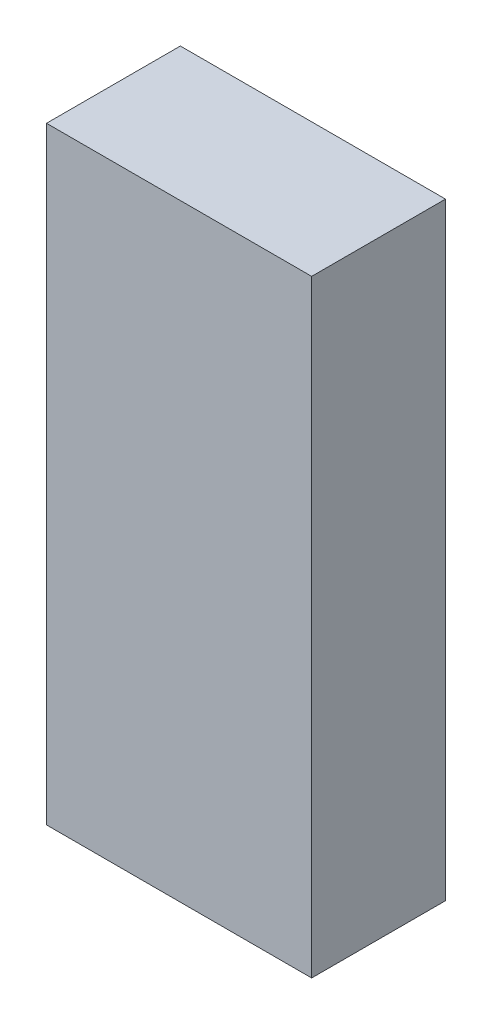
ISO-10303-21;
HEADER;
FILE_DESCRIPTION(('STEP AP214'),'2;1');
FILE_NAME('part.step','',(''),(''),'','','');
FILE_SCHEMA(('AUTOMOTIVE_DESIGN { 1 0 10303 214 1 1 1 1 }'));
ENDSEC;
DATA;
#1=APPLICATION_CONTEXT('core data for automotive mechanical design processes');
#2=APPLICATION_PROTOCOL_DEFINITION('international standard','automotive_design',2000,#1);
#3=PRODUCT_CONTEXT('',#1,'mechanical');
#4=PRODUCT('Part','Part','',(#3));
#5=PRODUCT_RELATED_PRODUCT_CATEGORY('part','',(#4));
#6=PRODUCT_DEFINITION_FORMATION('','',#4);
#7=PRODUCT_DEFINITION_CONTEXT('part definition',#1,'design');
#8=PRODUCT_DEFINITION('design','',#6,#7);
#9=PRODUCT_DEFINITION_SHAPE('','',#8);
#10=(LENGTH_UNIT() NAMED_UNIT(*) SI_UNIT(.MILLI.,.METRE.));
#11=(NAMED_UNIT(*) PLANE_ANGLE_UNIT() SI_UNIT($,.RADIAN.));
#12=(NAMED_UNIT(*) SI_UNIT($,.STERADIAN.) SOLID_ANGLE_UNIT());
#13=UNCERTAINTY_MEASURE_WITH_UNIT(LENGTH_MEASURE(1.E-05),#10,'distance_accuracy_value','');
#14=(GEOMETRIC_REPRESENTATION_CONTEXT(3) GLOBAL_UNCERTAINTY_ASSIGNED_CONTEXT((#13)) GLOBAL_UNIT_ASSIGNED_CONTEXT((#10,
#11,#12)) REPRESENTATION_CONTEXT('',''));
#15=CARTESIAN_POINT('',(0.,0.,0.));
#16=DIRECTION('',(0.,0.,1.));
#17=DIRECTION('',(1.,0.,0.));
#18=AXIS2_PLACEMENT_3D('',#15,#16,#17);
#19=CARTESIAN_POINT('',(0.2515997,0.57659778,0.));
#20=DIRECTION('',(0.,-1.,0.));
#21=DIRECTION('',(-1.,0.,0.));
#22=AXIS2_PLACEMENT_3D('',#19,#20,#21);
#23=PLANE('',#22);
#24=DIRECTION('',(-1.,0.,0.));
#25=VECTOR('',#24,1.);
#26=CARTESIAN_POINT('',(0.2515997,0.57659778,0.));
#27=LINE('',#26,#25);
#28=CARTESIAN_POINT('',(0.2515997,0.57659778,0.));
#29=VERTEX_POINT('',#28);
#30=CARTESIAN_POINT('',(-0.2515997,0.57659778,0.));
#31=VERTEX_POINT('',#30);
#32=EDGE_CURVE('E11',#29,#31,#27,.T.);
#33=ORIENTED_EDGE('',*,*,#32,.T.);
#34=DIRECTION('',(0.,0.,1.));
#35=VECTOR('',#34,1.);
#36=CARTESIAN_POINT('',(-0.2515997,0.57659778,0.));
#37=LINE('',#36,#35);
#38=CARTESIAN_POINT('',(-0.2515997,0.57659778,0.254));
#39=VERTEX_POINT('',#38);
#40=EDGE_CURVE('E24',#31,#39,#37,.T.);
#41=ORIENTED_EDGE('',*,*,#40,.T.);
#42=DIRECTION('',(-1.,0.,0.));
#43=VECTOR('',#42,1.);
#44=CARTESIAN_POINT('',(0.2515997,0.57659778,0.254));
#45=LINE('',#44,#43);
#46=CARTESIAN_POINT('',(0.2515997,0.57659778,0.254));
#47=VERTEX_POINT('',#46);
#48=EDGE_CURVE('E87',#47,#39,#45,.T.);
#49=ORIENTED_EDGE('',*,*,#48,.F.);
#50=DIRECTION('',(0.,0.,1.));
#51=VECTOR('',#50,1.);
#52=CARTESIAN_POINT('',(0.2515997,0.57659778,0.));
#53=LINE('',#52,#51);
#54=EDGE_CURVE('E36',#29,#47,#53,.T.);
#55=ORIENTED_EDGE('',*,*,#54,.F.);
#56=EDGE_LOOP('',(#33,#41,#49,#55));
#57=FACE_BOUND('',#56,.T.);
#58=ADVANCED_FACE('F17',(#57),#23,.F.);
#59=CARTESIAN_POINT('',(-0.2515997,0.57659778,0.));
#60=DIRECTION('',(1.,0.,0.));
#61=DIRECTION('',(0.,-1.,0.));
#62=AXIS2_PLACEMENT_3D('',#59,#60,#61);
#63=PLANE('',#62);
#64=DIRECTION('',(0.,-1.,0.));
#65=VECTOR('',#64,1.);
#66=CARTESIAN_POINT('',(-0.2515997,0.57659778,0.));
#67=LINE('',#66,#65);
#68=CARTESIAN_POINT('',(-0.2515997,-0.57659778,0.));
#69=VERTEX_POINT('',#68);
#70=EDGE_CURVE('E84',#31,#69,#67,.T.);
#71=ORIENTED_EDGE('',*,*,#70,.T.);
#72=DIRECTION('',(0.,0.,1.));
#73=VECTOR('',#72,1.);
#74=CARTESIAN_POINT('',(-0.2515997,-0.57659778,0.));
#75=LINE('',#74,#73);
#76=CARTESIAN_POINT('',(-0.2515997,-0.57659778,0.254));
#77=VERTEX_POINT('',#76);
#78=EDGE_CURVE('E82',#69,#77,#75,.T.);
#79=ORIENTED_EDGE('',*,*,#78,.T.);
#80=DIRECTION('',(0.,-1.,0.));
#81=VECTOR('',#80,1.);
#82=CARTESIAN_POINT('',(-0.2515997,0.57659778,0.254));
#83=LINE('',#82,#81);
#84=EDGE_CURVE('E62',#39,#77,#83,.T.);
#85=ORIENTED_EDGE('',*,*,#84,.F.);
#86=ORIENTED_EDGE('',*,*,#40,.F.);
#87=EDGE_LOOP('',(#71,#79,#85,#86));
#88=FACE_BOUND('',#87,.T.);
#89=ADVANCED_FACE('F89',(#88),#63,.F.);
#90=CARTESIAN_POINT('',(-0.2515997,-0.57659778,0.));
#91=DIRECTION('',(0.,1.,0.));
#92=DIRECTION('',(1.,0.,0.));
#93=AXIS2_PLACEMENT_3D('',#90,#91,#92);
#94=PLANE('',#93);
#95=DIRECTION('',(1.,0.,0.));
#96=VECTOR('',#95,1.);
#97=CARTESIAN_POINT('',(-0.2515997,-0.57659778,0.));
#98=LINE('',#97,#96);
#99=CARTESIAN_POINT('',(0.2515997,-0.57659778,0.));
#100=VERTEX_POINT('',#99);
#101=EDGE_CURVE('E71',#69,#100,#98,.T.);
#102=ORIENTED_EDGE('',*,*,#101,.T.);
#103=DIRECTION('',(0.,0.,1.));
#104=VECTOR('',#103,1.);
#105=CARTESIAN_POINT('',(0.2515997,-0.57659778,0.));
#106=LINE('',#105,#104);
#107=CARTESIAN_POINT('',(0.2515997,-0.57659778,0.254));
#108=VERTEX_POINT('',#107);
#109=EDGE_CURVE('E65',#100,#108,#106,.T.);
#110=ORIENTED_EDGE('',*,*,#109,.T.);
#111=DIRECTION('',(1.,0.,0.));
#112=VECTOR('',#111,1.);
#113=CARTESIAN_POINT('',(-0.2515997,-0.57659778,0.254));
#114=LINE('',#113,#112);
#115=EDGE_CURVE('E57',#77,#108,#114,.T.);
#116=ORIENTED_EDGE('',*,*,#115,.F.);
#117=ORIENTED_EDGE('',*,*,#78,.F.);
#118=EDGE_LOOP('',(#102,#110,#116,#117));
#119=FACE_BOUND('',#118,.T.);
#120=ADVANCED_FACE('F69',(#119),#94,.F.);
#121=CARTESIAN_POINT('',(0.2515997,-0.57659778,0.));
#122=DIRECTION('',(-1.,0.,0.));
#123=DIRECTION('',(0.,1.,0.));
#124=AXIS2_PLACEMENT_3D('',#121,#122,#123);
#125=PLANE('',#124);
#126=DIRECTION('',(0.,1.,0.));
#127=VECTOR('',#126,1.);
#128=CARTESIAN_POINT('',(0.2515997,-0.57659778,0.));
#129=LINE('',#128,#127);
#130=EDGE_CURVE('E66',#100,#29,#129,.T.);
#131=ORIENTED_EDGE('',*,*,#130,.T.);
#132=ORIENTED_EDGE('',*,*,#54,.T.);
#133=DIRECTION('',(0.,1.,0.));
#134=VECTOR('',#133,1.);
#135=CARTESIAN_POINT('',(0.2515997,-0.57659778,0.254));
#136=LINE('',#135,#134);
#137=EDGE_CURVE('E61',#108,#47,#136,.T.);
#138=ORIENTED_EDGE('',*,*,#137,.F.);
#139=ORIENTED_EDGE('',*,*,#109,.F.);
#140=EDGE_LOOP('',(#131,#132,#138,#139));
#141=FACE_BOUND('',#140,.T.);
#142=ADVANCED_FACE('F76',(#141),#125,.F.);
#143=CARTESIAN_POINT('',(0.2515997,0.57659778,0.));
#144=DIRECTION('',(0.,0.,-1.));
#145=DIRECTION('',(-1.,0.,0.));
#146=AXIS2_PLACEMENT_3D('',#143,#144,#145);
#147=PLANE('',#146);
#148=ORIENTED_EDGE('',*,*,#130,.F.);
#149=ORIENTED_EDGE('',*,*,#101,.F.);
#150=ORIENTED_EDGE('',*,*,#70,.F.);
#151=ORIENTED_EDGE('',*,*,#32,.F.);
#152=EDGE_LOOP('',(#148,#149,#150,#151));
#153=FACE_BOUND('',#152,.T.);
#154=ADVANCED_FACE('F91',(#153),#147,.T.);
#155=CARTESIAN_POINT('',(0.2515997,0.57659778,0.254));
#156=DIRECTION('',(0.,0.,-1.));
#157=DIRECTION('',(-1.,0.,0.));
#158=AXIS2_PLACEMENT_3D('',#155,#156,#157);
#159=PLANE('',#158);
#160=ORIENTED_EDGE('',*,*,#48,.T.);
#161=ORIENTED_EDGE('',*,*,#84,.T.);
#162=ORIENTED_EDGE('',*,*,#115,.T.);
#163=ORIENTED_EDGE('',*,*,#137,.T.);
#164=EDGE_LOOP('',(#160,#161,#162,#163));
#165=FACE_BOUND('',#164,.T.);
#166=ADVANCED_FACE('F59',(#165),#159,.F.);
#167=CLOSED_SHELL('',(#58,#89,#120,#142,#154,#166));
#168=MANIFOLD_SOLID_BREP('B1',#167);
#169=ADVANCED_BREP_SHAPE_REPRESENTATION('',(#18,#168),#14);
#170=SHAPE_DEFINITION_REPRESENTATION(#9,#169);
ENDSEC;
END-ISO-10303-21;
